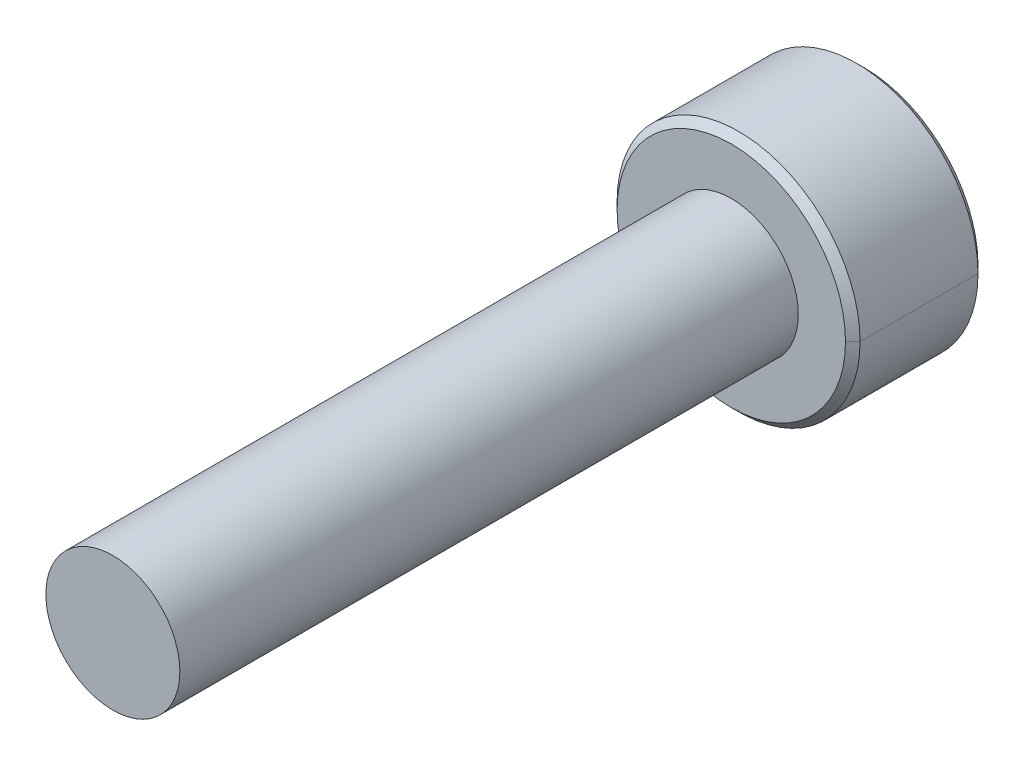
ISO-10303-21;
HEADER;
FILE_DESCRIPTION(('STEP AP214'),'2;1');
FILE_NAME('part.step','',(''),(''),'','','');
FILE_SCHEMA(('AUTOMOTIVE_DESIGN { 1 0 10303 214 1 1 1 1 }'));
ENDSEC;
DATA;
#1=APPLICATION_CONTEXT('core data for automotive mechanical design processes');
#2=APPLICATION_PROTOCOL_DEFINITION('international standard','automotive_design',2000,#1);
#3=PRODUCT_CONTEXT('',#1,'mechanical');
#4=PRODUCT('Part','Part','',(#3));
#5=PRODUCT_RELATED_PRODUCT_CATEGORY('part','',(#4));
#6=PRODUCT_DEFINITION_FORMATION('','',#4);
#7=PRODUCT_DEFINITION_CONTEXT('part definition',#1,'design');
#8=PRODUCT_DEFINITION('design','',#6,#7);
#9=PRODUCT_DEFINITION_SHAPE('','',#8);
#10=(LENGTH_UNIT() NAMED_UNIT(*) SI_UNIT(.MILLI.,.METRE.));
#11=(NAMED_UNIT(*) PLANE_ANGLE_UNIT() SI_UNIT($,.RADIAN.));
#12=(NAMED_UNIT(*) SI_UNIT($,.STERADIAN.) SOLID_ANGLE_UNIT());
#13=UNCERTAINTY_MEASURE_WITH_UNIT(LENGTH_MEASURE(1.E-05),#10,'distance_accuracy_value','');
#14=(GEOMETRIC_REPRESENTATION_CONTEXT(3) GLOBAL_UNCERTAINTY_ASSIGNED_CONTEXT((#13)) GLOBAL_UNIT_ASSIGNED_CONTEXT((#10,
#11,#12)) REPRESENTATION_CONTEXT('',''));
#15=CARTESIAN_POINT('',(0.,0.,0.));
#16=DIRECTION('',(0.,0.,1.));
#17=DIRECTION('',(1.,0.,0.));
#18=AXIS2_PLACEMENT_3D('',#15,#16,#17);
#19=CARTESIAN_POINT('',(0.,0.,-6.165));
#20=DIRECTION('',(0.,0.,-1.));
#21=DIRECTION('',(-1.,0.,0.));
#22=AXIS2_PLACEMENT_3D('',#19,#20,#21);
#23=CONICAL_SURFACE('',#22,2.75,0.785398163397453);
#24=CARTESIAN_POINT('',(0.,0.,-6.));
#25=DIRECTION('',(0.,0.,1.));
#26=DIRECTION('',(-1.,0.,0.));
#27=AXIS2_PLACEMENT_3D('',#24,#25,#26);
#28=CIRCLE('',#27,2.585);
#29=CARTESIAN_POINT('',(2.585,0.,-6.));
#30=VERTEX_POINT('',#29);
#31=CARTESIAN_POINT('',(-2.585,0.,-6.));
#32=VERTEX_POINT('',#31);
#33=EDGE_CURVE('E61',#30,#32,#28,.T.);
#34=ORIENTED_EDGE('',*,*,#33,.F.);
#35=DIRECTION('',(0.707106781186551,0.,-0.707106781186544));
#36=VECTOR('',#35,1.);
#37=CARTESIAN_POINT('',(2.75,0.,-6.165));
#38=LINE('',#37,#36);
#39=CARTESIAN_POINT('',(2.75,0.,-6.165));
#40=VERTEX_POINT('',#39);
#41=EDGE_CURVE('E11',#30,#40,#38,.T.);
#42=ORIENTED_EDGE('',*,*,#41,.T.);
#43=CARTESIAN_POINT('',(0.,0.,-6.165));
#44=DIRECTION('',(0.,0.,-1.));
#45=DIRECTION('',(-1.,0.,0.));
#46=AXIS2_PLACEMENT_3D('',#43,#44,#45);
#47=CIRCLE('',#46,2.75);
#48=CARTESIAN_POINT('',(-2.75,0.,-6.165));
#49=VERTEX_POINT('',#48);
#50=EDGE_CURVE('E475',#49,#40,#47,.T.);
#51=ORIENTED_EDGE('',*,*,#50,.F.);
#52=DIRECTION('',(-0.707106781186551,0.,-0.707106781186544));
#53=VECTOR('',#52,1.);
#54=CARTESIAN_POINT('',(-2.75,0.,-6.165));
#55=LINE('',#54,#53);
#56=EDGE_CURVE('E487',#32,#49,#55,.T.);
#57=ORIENTED_EDGE('',*,*,#56,.F.);
#58=EDGE_LOOP('',(#34,#42,#51,#57));
#59=FACE_BOUND('',#58,.T.);
#60=ADVANCED_FACE('F36',(#59),#23,.T.);
#61=CARTESIAN_POINT('',(0.,0.,-9.));
#62=DIRECTION('',(0.,0.,1.));
#63=DIRECTION('',(1.,0.,0.));
#64=AXIS2_PLACEMENT_3D('',#61,#62,#63);
#65=CONICAL_SURFACE('',#64,2.585,0.785398163397446);
#66=CARTESIAN_POINT('',(0.,0.,-9.));
#67=DIRECTION('',(0.,0.,-1.));
#68=DIRECTION('',(-1.,0.,0.));
#69=AXIS2_PLACEMENT_3D('',#66,#67,#68);
#70=CIRCLE('',#69,2.585);
#71=CARTESIAN_POINT('',(-2.585,0.,-9.));
#72=VERTEX_POINT('',#71);
#73=CARTESIAN_POINT('',(2.585,0.,-9.));
#74=VERTEX_POINT('',#73);
#75=EDGE_CURVE('E396',#72,#74,#70,.T.);
#76=ORIENTED_EDGE('',*,*,#75,.F.);
#77=DIRECTION('',(-0.707106781186546,0.,0.707106781186549));
#78=VECTOR('',#77,1.);
#79=CARTESIAN_POINT('',(-2.585,0.,-9.));
#80=LINE('',#79,#78);
#81=CARTESIAN_POINT('',(-2.75,0.,-8.835));
#82=VERTEX_POINT('',#81);
#83=EDGE_CURVE('E49',#72,#82,#80,.T.);
#84=ORIENTED_EDGE('',*,*,#83,.T.);
#85=CARTESIAN_POINT('',(0.,0.,-8.835));
#86=DIRECTION('',(0.,0.,1.));
#87=DIRECTION('',(-1.,0.,0.));
#88=AXIS2_PLACEMENT_3D('',#85,#86,#87);
#89=CIRCLE('',#88,2.75);
#90=CARTESIAN_POINT('',(2.75,0.,-8.835));
#91=VERTEX_POINT('',#90);
#92=EDGE_CURVE('E468',#91,#82,#89,.T.);
#93=ORIENTED_EDGE('',*,*,#92,.F.);
#94=DIRECTION('',(0.707106781186546,0.,0.707106781186549));
#95=VECTOR('',#94,1.);
#96=CARTESIAN_POINT('',(2.585,0.,-9.));
#97=LINE('',#96,#95);
#98=EDGE_CURVE('E400',#74,#91,#97,.T.);
#99=ORIENTED_EDGE('',*,*,#98,.F.);
#100=EDGE_LOOP('',(#76,#84,#93,#99));
#101=FACE_BOUND('',#100,.T.);
#102=ADVANCED_FACE('F246',(#101),#65,.T.);
#103=CARTESIAN_POINT('',(0.,0.,-9.));
#104=DIRECTION('',(0.,0.,-1.));
#105=DIRECTION('',(-1.,0.,0.));
#106=AXIS2_PLACEMENT_3D('',#103,#104,#105);
#107=CONICAL_SURFACE('',#106,1.44337567297406,0.78539816339745);
#108=CARTESIAN_POINT('',(-1.25,0.,-8.80662432702593));
#109=CARTESIAN_POINT('',(-1.25,0.180896648900341,-8.80662432702593));
#110=CARTESIAN_POINT('',(-1.25,0.371633306232305,-8.8606992153283));
#111=CARTESIAN_POINT('',(-1.25,0.536655871568181,-8.90748401754058));
#112=CARTESIAN_POINT('',(-1.25,0.721687836487031,-9.));
#113=B_SPLINE_CURVE_WITH_KNOTS('',2,(#108,#109,#110,#111,#112),.UNSPECIFIED.,.F.,.F.,(3,2,3),
(0.,0.5,1.),.UNSPECIFIED.);
#114=CARTESIAN_POINT('',(-1.25,0.,-8.80662432702594));
#115=VERTEX_POINT('',#114);
#116=CARTESIAN_POINT('',(-1.25,0.721687836487032,-9.));
#117=VERTEX_POINT('',#116);
#118=EDGE_CURVE('E184',#115,#117,#113,.T.);
#119=ORIENTED_EDGE('',*,*,#118,.F.);
#120=DIRECTION('',(-0.707106781186549,0.,-0.707106781186546));
#121=VECTOR('',#120,1.);
#122=CARTESIAN_POINT('',(-1.44337567297406,0.,-9.));
#123=LINE('',#122,#121);
#124=CARTESIAN_POINT('',(-1.44337567297406,0.,-9.));
#125=VERTEX_POINT('',#124);
#126=EDGE_CURVE('E413',#115,#125,#123,.T.);
#127=ORIENTED_EDGE('',*,*,#126,.T.);
#128=CARTESIAN_POINT('',(0.,0.,-9.));
#129=DIRECTION('',(0.,0.,-1.));
#130=DIRECTION('',(-1.,0.,0.));
#131=AXIS2_PLACEMENT_3D('',#128,#129,#130);
#132=CIRCLE('',#131,1.44337567297406);
#133=EDGE_CURVE('E233',#125,#117,#132,.T.);
#134=ORIENTED_EDGE('',*,*,#133,.T.);
#135=EDGE_LOOP('',(#119,#127,#134));
#136=FACE_BOUND('',#135,.T.);
#137=ADVANCED_FACE('F235',(#136),#107,.F.);
#138=CARTESIAN_POINT('',(0.,0.,-9.));
#139=DIRECTION('',(0.,0.,1.));
#140=DIRECTION('',(1.,0.,0.));
#141=AXIS2_PLACEMENT_3D('',#138,#139,#140);
#142=CYLINDRICAL_SURFACE('',#141,2.75);
#143=ORIENTED_EDGE('',*,*,#92,.T.);
#144=DIRECTION('',(0.,0.,1.));
#145=VECTOR('',#144,1.);
#146=CARTESIAN_POINT('',(-2.75,0.,-9.));
#147=LINE('',#146,#145);
#148=EDGE_CURVE('E427',#82,#49,#147,.T.);
#149=ORIENTED_EDGE('',*,*,#148,.T.);
#150=ORIENTED_EDGE('',*,*,#50,.T.);
#151=DIRECTION('',(0.,0.,1.));
#152=VECTOR('',#151,1.);
#153=CARTESIAN_POINT('',(2.75,0.,-9.));
#154=LINE('',#153,#152);
#155=EDGE_CURVE('E423',#91,#40,#154,.T.);
#156=ORIENTED_EDGE('',*,*,#155,.F.);
#157=EDGE_LOOP('',(#143,#149,#150,#156));
#158=FACE_BOUND('',#157,.T.);
#159=ADVANCED_FACE('F245',(#158),#142,.T.);
#160=CARTESIAN_POINT('',(0.,0.,-9.));
#161=DIRECTION('',(0.,0.,1.));
#162=DIRECTION('',(1.,0.,0.));
#163=AXIS2_PLACEMENT_3D('',#160,#161,#162);
#164=CYLINDRICAL_SURFACE('',#163,2.75);
#165=ORIENTED_EDGE('',*,*,#148,.F.);
#166=CARTESIAN_POINT('',(0.,0.,-8.835));
#167=DIRECTION('',(0.,0.,1.));
#168=DIRECTION('',(-1.,0.,0.));
#169=AXIS2_PLACEMENT_3D('',#166,#167,#168);
#170=CIRCLE('',#169,2.75);
#171=EDGE_CURVE('E411',#82,#91,#170,.T.);
#172=ORIENTED_EDGE('',*,*,#171,.T.);
#173=ORIENTED_EDGE('',*,*,#155,.T.);
#174=CARTESIAN_POINT('',(0.,0.,-6.165));
#175=DIRECTION('',(0.,0.,-1.));
#176=DIRECTION('',(-1.,0.,0.));
#177=AXIS2_PLACEMENT_3D('',#174,#175,#176);
#178=CIRCLE('',#177,2.75);
#179=EDGE_CURVE('E417',#40,#49,#178,.T.);
#180=ORIENTED_EDGE('',*,*,#179,.T.);
#181=EDGE_LOOP('',(#165,#172,#173,#180));
#182=FACE_BOUND('',#181,.T.);
#183=ADVANCED_FACE('F378',(#182),#164,.T.);
#184=CARTESIAN_POINT('',(0.,0.,-9.));
#185=DIRECTION('',(0.,0.,-1.));
#186=DIRECTION('',(0.,-1.,0.));
#187=AXIS2_PLACEMENT_3D('',#184,#185,#186);
#188=PLANE('',#187);
#189=CARTESIAN_POINT('',(0.,0.,-9.));
#190=DIRECTION('',(0.,0.,-1.));
#191=DIRECTION('',(-1.,0.,0.));
#192=AXIS2_PLACEMENT_3D('',#189,#190,#191);
#193=CIRCLE('',#192,2.585);
#194=EDGE_CURVE('E405',#74,#72,#193,.T.);
#195=ORIENTED_EDGE('',*,*,#194,.T.);
#196=ORIENTED_EDGE('',*,*,#75,.T.);
#197=EDGE_LOOP('',(#195,#196));
#198=FACE_BOUND('',#197,.T.);
#199=CARTESIAN_POINT('',(0.,0.,-9.));
#200=DIRECTION('',(0.,0.,-1.));
#201=DIRECTION('',(-1.,0.,0.));
#202=AXIS2_PLACEMENT_3D('',#199,#200,#201);
#203=CIRCLE('',#202,1.44337567297406);
#204=CARTESIAN_POINT('',(0.,1.44337567297406,-9.));
#205=VERTEX_POINT('',#204);
#206=EDGE_CURVE('E307',#117,#205,#203,.T.);
#207=ORIENTED_EDGE('',*,*,#206,.F.);
#208=ORIENTED_EDGE('',*,*,#133,.F.);
#209=CARTESIAN_POINT('',(0.,0.,-9.));
#210=DIRECTION('',(0.,0.,-1.));
#211=DIRECTION('',(-1.,0.,0.));
#212=AXIS2_PLACEMENT_3D('',#209,#210,#211);
#213=CIRCLE('',#212,1.44337567297406);
#214=CARTESIAN_POINT('',(-1.25,-0.721687836487033,-9.));
#215=VERTEX_POINT('',#214);
#216=EDGE_CURVE('E271',#215,#125,#213,.T.);
#217=ORIENTED_EDGE('',*,*,#216,.F.);
#218=CARTESIAN_POINT('',(0.,0.,-9.));
#219=DIRECTION('',(0.,0.,-1.));
#220=DIRECTION('',(-1.,0.,0.));
#221=AXIS2_PLACEMENT_3D('',#218,#219,#220);
#222=CIRCLE('',#221,1.44337567297406);
#223=CARTESIAN_POINT('',(0.,-1.44337567297406,-9.));
#224=VERTEX_POINT('',#223);
#225=EDGE_CURVE('E262',#224,#215,#222,.T.);
#226=ORIENTED_EDGE('',*,*,#225,.F.);
#227=CARTESIAN_POINT('',(0.,0.,-9.));
#228=DIRECTION('',(0.,0.,-1.));
#229=DIRECTION('',(-1.,0.,0.));
#230=AXIS2_PLACEMENT_3D('',#227,#228,#229);
#231=CIRCLE('',#230,1.44337567297406);
#232=CARTESIAN_POINT('',(1.25,-0.721687836487033,-9.));
#233=VERTEX_POINT('',#232);
#234=EDGE_CURVE('E270',#233,#224,#231,.T.);
#235=ORIENTED_EDGE('',*,*,#234,.F.);
#236=CARTESIAN_POINT('',(0.,0.,-9.));
#237=DIRECTION('',(0.,0.,-1.));
#238=DIRECTION('',(-1.,0.,0.));
#239=AXIS2_PLACEMENT_3D('',#236,#237,#238);
#240=CIRCLE('',#239,1.44337567297406);
#241=CARTESIAN_POINT('',(1.25,0.721687836487033,-9.));
#242=VERTEX_POINT('',#241);
#243=EDGE_CURVE('E335',#242,#233,#240,.T.);
#244=ORIENTED_EDGE('',*,*,#243,.F.);
#245=CARTESIAN_POINT('',(0.,0.,-9.));
#246=DIRECTION('',(0.,0.,-1.));
#247=DIRECTION('',(-1.,0.,0.));
#248=AXIS2_PLACEMENT_3D('',#245,#246,#247);
#249=CIRCLE('',#248,1.44337567297406);
#250=EDGE_CURVE('E331',#205,#242,#249,.T.);
#251=ORIENTED_EDGE('',*,*,#250,.F.);
#252=EDGE_LOOP('',(#207,#208,#217,#226,#235,#244,#251));
#253=FACE_BOUND('',#252,.T.);
#254=ADVANCED_FACE('F383',(#198,#253),#188,.T.);
#255=CARTESIAN_POINT('',(0.,0.,-6.));
#256=DIRECTION('',(0.,0.,-1.));
#257=DIRECTION('',(0.,-1.,0.));
#258=AXIS2_PLACEMENT_3D('',#255,#256,#257);
#259=PLANE('',#258);
#260=CARTESIAN_POINT('',(0.,0.,-6.));
#261=DIRECTION('',(0.,0.,-1.));
#262=DIRECTION('',(-1.,0.,0.));
#263=AXIS2_PLACEMENT_3D('',#260,#261,#262);
#264=CIRCLE('',#263,1.51645395010895);
#265=CARTESIAN_POINT('',(-1.51645395010895,0.,-6.));
#266=VERTEX_POINT('',#265);
#267=EDGE_CURVE('E499',#266,#266,#264,.F.);
#268=ORIENTED_EDGE('',*,*,#267,.F.);
#269=EDGE_LOOP('',(#268));
#270=FACE_BOUND('',#269,.T.);
#271=CARTESIAN_POINT('',(0.,0.,-6.));
#272=DIRECTION('',(0.,0.,1.));
#273=DIRECTION('',(-1.,0.,0.));
#274=AXIS2_PLACEMENT_3D('',#271,#272,#273);
#275=CIRCLE('',#274,2.585);
#276=EDGE_CURVE('E406',#32,#30,#275,.T.);
#277=ORIENTED_EDGE('',*,*,#276,.T.);
#278=ORIENTED_EDGE('',*,*,#33,.T.);
#279=EDGE_LOOP('',(#277,#278));
#280=FACE_BOUND('',#279,.T.);
#281=ADVANCED_FACE('F519',(#270,#280),#259,.F.);
#282=CARTESIAN_POINT('',(0.,0.,-9.));
#283=DIRECTION('',(0.,0.,-1.));
#284=DIRECTION('',(-1.,0.,0.));
#285=AXIS2_PLACEMENT_3D('',#282,#283,#284);
#286=CONICAL_SURFACE('',#285,1.44337567297406,0.78539816339745);
#287=ORIENTED_EDGE('',*,*,#250,.T.);
#288=CARTESIAN_POINT('',(0.,1.44337567297406,-9.));
#289=CARTESIAN_POINT('',(0.33343931272324,1.2508643960149,-8.80748872304083));
#290=CARTESIAN_POINT('',(0.622697264378245,1.08386123976164,-8.80662715507142));
#291=CARTESIAN_POINT('',(0.91356780893043,0.915927052565104,-8.8057607839207));
#292=CARTESIAN_POINT('',(1.25,0.721687836487032,-9.));
#293=B_SPLINE_CURVE_WITH_KNOTS('',2,(#288,#289,#290,#291,#292),.UNSPECIFIED.,.F.,.F.,(3,2,3),
(0.,0.5,1.),.UNSPECIFIED.);
#294=EDGE_CURVE('E341',#205,#242,#293,.T.);
#295=ORIENTED_EDGE('',*,*,#294,.F.);
#296=EDGE_LOOP('',(#287,#295));
#297=FACE_BOUND('',#296,.T.);
#298=ADVANCED_FACE('F522',(#297),#286,.F.);
#299=CARTESIAN_POINT('',(0.,0.,-9.));
#300=DIRECTION('',(0.,0.,-1.));
#301=DIRECTION('',(-1.,0.,0.));
#302=AXIS2_PLACEMENT_3D('',#299,#300,#301);
#303=CONICAL_SURFACE('',#302,1.44337567297406,0.78539816339745);
#304=ORIENTED_EDGE('',*,*,#243,.T.);
#305=CARTESIAN_POINT('',(1.25,0.721687836487033,-9.));
#306=CARTESIAN_POINT('',(1.25,0.538092414489122,-8.90820228900105));
#307=CARTESIAN_POINT('',(1.25,0.371670740916257,-8.86070988390206));
#308=CARTESIAN_POINT('',(1.25,0.182469151639214,-8.8067166849971));
#309=CARTESIAN_POINT('',(1.25,7.86844095029566E-05,-8.80662432950243));
#310=CARTESIAN_POINT('',(1.25,-0.1812567100001,-8.80653250825594));
#311=CARTESIAN_POINT('',(1.25,-0.371515987727131,-8.86066578692546));
#312=CARTESIAN_POINT('',(1.25,-0.537435467853739,-8.90787381568336));
#313=CARTESIAN_POINT('',(1.25,-0.721687836487031,-9.));
#314=B_SPLINE_CURVE_WITH_KNOTS('',2,(#305,#306,#307,#308,#309,#310,#311,#312,#313),
.UNSPECIFIED.,.F.,.F.,(3,2,2,2,3),(0.,0.25,0.5,0.75,1.),.UNSPECIFIED.);
#315=EDGE_CURVE('E353',#242,#233,#314,.T.);
#316=ORIENTED_EDGE('',*,*,#315,.F.);
#317=EDGE_LOOP('',(#304,#316));
#318=FACE_BOUND('',#317,.T.);
#319=ADVANCED_FACE('F253',(#318),#303,.F.);
#320=CARTESIAN_POINT('',(0.,0.,-9.));
#321=DIRECTION('',(0.,0.,-1.));
#322=DIRECTION('',(-1.,0.,0.));
#323=AXIS2_PLACEMENT_3D('',#320,#321,#322);
#324=CONICAL_SURFACE('',#323,1.44337567297406,0.78539816339745);
#325=ORIENTED_EDGE('',*,*,#234,.T.);
#326=CARTESIAN_POINT('',(1.25,-0.721687836487033,-9.));
#327=CARTESIAN_POINT('',(0.916560687278648,-0.91419911344511,-8.80748872304191));
#328=CARTESIAN_POINT('',(0.627302735621754,-1.08120226969946,-8.80662715507142));
#329=CARTESIAN_POINT('',(0.336432191071441,-1.24913645689491,-8.80576078391962));
#330=CARTESIAN_POINT('',(0.,-1.44337567297406,-9.));
#331=B_SPLINE_CURVE_WITH_KNOTS('',2,(#326,#327,#328,#329,#330),.UNSPECIFIED.,.F.,.F.,(3,2,3),
(0.,0.5,1.),.UNSPECIFIED.);
#332=EDGE_CURVE('E276',#233,#224,#331,.T.);
#333=ORIENTED_EDGE('',*,*,#332,.F.);
#334=EDGE_LOOP('',(#325,#333));
#335=FACE_BOUND('',#334,.T.);
#336=ADVANCED_FACE('F248',(#335),#324,.F.);
#337=CARTESIAN_POINT('',(0.,0.,-9.));
#338=DIRECTION('',(0.,0.,-1.));
#339=DIRECTION('',(-1.,0.,0.));
#340=AXIS2_PLACEMENT_3D('',#337,#338,#339);
#341=CONICAL_SURFACE('',#340,1.44337567297406,0.78539816339745);
#342=ORIENTED_EDGE('',*,*,#225,.T.);
#343=CARTESIAN_POINT('',(0.,-1.44337567297406,-9.));
#344=CARTESIAN_POINT('',(-0.333439312720416,-1.25086439601653,-8.80748872304245));
#345=CARTESIAN_POINT('',(-0.622697264378245,-1.08386123976164,-8.80662715507142));
#346=CARTESIAN_POINT('',(-0.913567808927632,-0.915927052566719,-8.80576078391908));
#347=CARTESIAN_POINT('',(-1.25,-0.721687836487032,-9.));
#348=B_SPLINE_CURVE_WITH_KNOTS('',2,(#343,#344,#345,#346,#347),.UNSPECIFIED.,.F.,.F.,(3,2,3),
(0.,0.5,1.),.UNSPECIFIED.);
#349=EDGE_CURVE('E172',#224,#215,#348,.T.);
#350=ORIENTED_EDGE('',*,*,#349,.F.);
#351=EDGE_LOOP('',(#342,#350));
#352=FACE_BOUND('',#351,.T.);
#353=ADVANCED_FACE('F252',(#352),#341,.F.);
#354=CARTESIAN_POINT('',(0.,0.,-9.));
#355=DIRECTION('',(0.,0.,-1.));
#356=DIRECTION('',(-1.,0.,0.));
#357=AXIS2_PLACEMENT_3D('',#354,#355,#356);
#358=CONICAL_SURFACE('',#357,1.44337567297406,0.78539816339745);
#359=ORIENTED_EDGE('',*,*,#126,.F.);
#360=CARTESIAN_POINT('',(-1.25,-0.721687836487033,-9.));
#361=CARTESIAN_POINT('',(-1.25,-0.538882168791653,-8.90859716615231));
#362=CARTESIAN_POINT('',(-1.25,-0.371553327845961,-8.86067642546119));
#363=CARTESIAN_POINT('',(-1.25,-0.182815114466653,-8.80662432702593));
#364=CARTESIAN_POINT('',(-1.25,0.,-8.80662432702593));
#365=B_SPLINE_CURVE_WITH_KNOTS('',2,(#360,#361,#362,#363,#364),.UNSPECIFIED.,.F.,.F.,(3,2,3),
(0.,0.5,1.),.UNSPECIFIED.);
#366=EDGE_CURVE('E176',#215,#115,#365,.T.);
#367=ORIENTED_EDGE('',*,*,#366,.F.);
#368=ORIENTED_EDGE('',*,*,#216,.T.);
#369=EDGE_LOOP('',(#359,#367,#368));
#370=FACE_BOUND('',#369,.T.);
#371=ADVANCED_FACE('F296',(#370),#358,.F.);
#372=CARTESIAN_POINT('',(0.,0.,-9.));
#373=DIRECTION('',(0.,0.,-1.));
#374=DIRECTION('',(-1.,0.,0.));
#375=AXIS2_PLACEMENT_3D('',#372,#373,#374);
#376=CONICAL_SURFACE('',#375,1.44337567297406,0.78539816339745);
#377=ORIENTED_EDGE('',*,*,#206,.T.);
#378=CARTESIAN_POINT('',(-1.25,0.721687836487033,-9.));
#379=CARTESIAN_POINT('',(-0.916560687279589,0.914199113444566,-8.80748872304245));
#380=CARTESIAN_POINT('',(-0.627302735621754,1.08120226969946,-8.80662715507142));
#381=CARTESIAN_POINT('',(-0.336432191072373,1.24913645689438,-8.80576078391908));
#382=CARTESIAN_POINT('',(0.,1.44337567297407,-9.));
#383=B_SPLINE_CURVE_WITH_KNOTS('',2,(#378,#379,#380,#381,#382),.UNSPECIFIED.,.F.,.F.,(3,2,3),
(0.,0.5,1.),.UNSPECIFIED.);
#384=EDGE_CURVE('E486',#117,#205,#383,.T.);
#385=ORIENTED_EDGE('',*,*,#384,.F.);
#386=EDGE_LOOP('',(#377,#385));
#387=FACE_BOUND('',#386,.T.);
#388=ADVANCED_FACE('F376',(#387),#376,.F.);
#389=CARTESIAN_POINT('',(1.25,2.1650635094611,-7.125));
#390=DIRECTION('',(0.,0.,-1.));
#391=DIRECTION('',(0.,-1.,0.));
#392=AXIS2_PLACEMENT_3D('',#389,#390,#391);
#393=PLANE('',#392);
#394=DIRECTION('',(0.866025403784439,0.5,0.));
#395=VECTOR('',#394,1.);
#396=CARTESIAN_POINT('',(-1.25,0.721687836487033,-7.125));
#397=LINE('',#396,#395);
#398=CARTESIAN_POINT('',(-1.25,0.721687836487033,-7.125));
#399=VERTEX_POINT('',#398);
#400=CARTESIAN_POINT('',(0.,1.44337567297406,-7.125));
#401=VERTEX_POINT('',#400);
#402=EDGE_CURVE('E314',#399,#401,#397,.T.);
#403=ORIENTED_EDGE('',*,*,#402,.T.);
#404=DIRECTION('',(0.866025403784439,-0.5,0.));
#405=VECTOR('',#404,1.);
#406=CARTESIAN_POINT('',(0.,1.44337567297406,-7.125));
#407=LINE('',#406,#405);
#408=CARTESIAN_POINT('',(1.25,0.721687836487033,-7.125));
#409=VERTEX_POINT('',#408);
#410=EDGE_CURVE('E322',#401,#409,#407,.T.);
#411=ORIENTED_EDGE('',*,*,#410,.T.);
#412=DIRECTION('',(0.,-1.,0.));
#413=VECTOR('',#412,1.);
#414=CARTESIAN_POINT('',(1.25,0.721687836487033,-7.125));
#415=LINE('',#414,#413);
#416=CARTESIAN_POINT('',(1.25,-0.721687836487033,-7.125));
#417=VERTEX_POINT('',#416);
#418=EDGE_CURVE('E430',#409,#417,#415,.T.);
#419=ORIENTED_EDGE('',*,*,#418,.T.);
#420=DIRECTION('',(-0.866025403784439,-0.5,0.));
#421=VECTOR('',#420,1.);
#422=CARTESIAN_POINT('',(1.25,-0.721687836487033,-7.125));
#423=LINE('',#422,#421);
#424=CARTESIAN_POINT('',(0.,-1.44337567297406,-7.125));
#425=VERTEX_POINT('',#424);
#426=EDGE_CURVE('E166',#417,#425,#423,.T.);
#427=ORIENTED_EDGE('',*,*,#426,.T.);
#428=DIRECTION('',(-0.866025403784439,0.5,0.));
#429=VECTOR('',#428,1.);
#430=CARTESIAN_POINT('',(0.,-1.44337567297406,-7.125));
#431=LINE('',#430,#429);
#432=CARTESIAN_POINT('',(-1.25,-0.721687836487033,-7.125));
#433=VERTEX_POINT('',#432);
#434=EDGE_CURVE('E143',#425,#433,#431,.T.);
#435=ORIENTED_EDGE('',*,*,#434,.T.);
#436=DIRECTION('',(0.,1.,0.));
#437=VECTOR('',#436,1.);
#438=CARTESIAN_POINT('',(-1.25,-0.721687836487033,-7.125));
#439=LINE('',#438,#437);
#440=EDGE_CURVE('E151',#433,#399,#439,.T.);
#441=ORIENTED_EDGE('',*,*,#440,.T.);
#442=EDGE_LOOP('',(#403,#411,#419,#427,#435,#441));
#443=FACE_BOUND('',#442,.T.);
#444=ADVANCED_FACE('F164',(#443),#393,.T.);
#445=CARTESIAN_POINT('',(0.,1.44337567297406,-7.125));
#446=DIRECTION('',(0.5,0.866025403784439,0.));
#447=DIRECTION('',(0.,0.,-1.));
#448=AXIS2_PLACEMENT_3D('',#445,#446,#447);
#449=PLANE('',#448);
#450=DIRECTION('',(0.,0.,-1.));
#451=VECTOR('',#450,1.);
#452=CARTESIAN_POINT('',(0.,1.44337567297406,-7.125));
#453=LINE('',#452,#451);
#454=EDGE_CURVE('E162',#401,#205,#453,.T.);
#455=ORIENTED_EDGE('',*,*,#454,.T.);
#456=ORIENTED_EDGE('',*,*,#294,.T.);
#457=DIRECTION('',(0.,0.,-1.));
#458=VECTOR('',#457,1.);
#459=CARTESIAN_POINT('',(1.25,0.721687836487033,-7.125));
#460=LINE('',#459,#458);
#461=EDGE_CURVE('E349',#409,#242,#460,.T.);
#462=ORIENTED_EDGE('',*,*,#461,.F.);
#463=ORIENTED_EDGE('',*,*,#410,.F.);
#464=EDGE_LOOP('',(#455,#456,#462,#463));
#465=FACE_BOUND('',#464,.T.);
#466=ADVANCED_FACE('F374',(#465),#449,.F.);
#467=CARTESIAN_POINT('',(1.25,0.721687836487033,-7.125));
#468=DIRECTION('',(1.,0.,0.));
#469=DIRECTION('',(0.,1.,0.));
#470=AXIS2_PLACEMENT_3D('',#467,#468,#469);
#471=PLANE('',#470);
#472=ORIENTED_EDGE('',*,*,#461,.T.);
#473=ORIENTED_EDGE('',*,*,#315,.T.);
#474=DIRECTION('',(0.,0.,-1.));
#475=VECTOR('',#474,1.);
#476=CARTESIAN_POINT('',(1.25,-0.721687836487033,-7.125));
#477=LINE('',#476,#475);
#478=EDGE_CURVE('E559',#417,#233,#477,.T.);
#479=ORIENTED_EDGE('',*,*,#478,.F.);
#480=ORIENTED_EDGE('',*,*,#418,.F.);
#481=EDGE_LOOP('',(#472,#473,#479,#480));
#482=FACE_BOUND('',#481,.T.);
#483=ADVANCED_FACE('F365',(#482),#471,.F.);
#484=CARTESIAN_POINT('',(1.25,-0.721687836487033,-7.125));
#485=DIRECTION('',(0.5,-0.866025403784439,0.));
#486=DIRECTION('',(0.,0.,-1.));
#487=AXIS2_PLACEMENT_3D('',#484,#485,#486);
#488=PLANE('',#487);
#489=ORIENTED_EDGE('',*,*,#478,.T.);
#490=ORIENTED_EDGE('',*,*,#332,.T.);
#491=DIRECTION('',(0.,0.,-1.));
#492=VECTOR('',#491,1.);
#493=CARTESIAN_POINT('',(0.,-1.44337567297406,-7.125));
#494=LINE('',#493,#492);
#495=EDGE_CURVE('E182',#425,#224,#494,.T.);
#496=ORIENTED_EDGE('',*,*,#495,.F.);
#497=ORIENTED_EDGE('',*,*,#426,.F.);
#498=EDGE_LOOP('',(#489,#490,#496,#497));
#499=FACE_BOUND('',#498,.T.);
#500=ADVANCED_FACE('F207',(#499),#488,.F.);
#501=CARTESIAN_POINT('',(0.,-1.44337567297406,-7.125));
#502=DIRECTION('',(-0.5,-0.866025403784439,0.));
#503=DIRECTION('',(-0.866025403784439,0.5,0.));
#504=AXIS2_PLACEMENT_3D('',#501,#502,#503);
#505=PLANE('',#504);
#506=ORIENTED_EDGE('',*,*,#495,.T.);
#507=ORIENTED_EDGE('',*,*,#349,.T.);
#508=DIRECTION('',(0.,0.,-1.));
#509=VECTOR('',#508,1.);
#510=CARTESIAN_POINT('',(-1.25,-0.721687836487033,-7.125));
#511=LINE('',#510,#509);
#512=EDGE_CURVE('E154',#433,#215,#511,.T.);
#513=ORIENTED_EDGE('',*,*,#512,.F.);
#514=ORIENTED_EDGE('',*,*,#434,.F.);
#515=EDGE_LOOP('',(#506,#507,#513,#514));
#516=FACE_BOUND('',#515,.T.);
#517=ADVANCED_FACE('F171',(#516),#505,.F.);
#518=CARTESIAN_POINT('',(-1.25,-0.721687836487033,-7.125));
#519=DIRECTION('',(-1.,0.,0.));
#520=DIRECTION('',(0.,0.,1.));
#521=AXIS2_PLACEMENT_3D('',#518,#519,#520);
#522=PLANE('',#521);
#523=ORIENTED_EDGE('',*,*,#512,.T.);
#524=ORIENTED_EDGE('',*,*,#366,.T.);
#525=ORIENTED_EDGE('',*,*,#118,.T.);
#526=DIRECTION('',(0.,0.,-1.));
#527=VECTOR('',#526,1.);
#528=CARTESIAN_POINT('',(-1.25,0.721687836487033,-7.125));
#529=LINE('',#528,#527);
#530=EDGE_CURVE('E157',#399,#117,#529,.T.);
#531=ORIENTED_EDGE('',*,*,#530,.F.);
#532=ORIENTED_EDGE('',*,*,#440,.F.);
#533=EDGE_LOOP('',(#523,#524,#525,#531,#532));
#534=FACE_BOUND('',#533,.T.);
#535=ADVANCED_FACE('F152',(#534),#522,.F.);
#536=CARTESIAN_POINT('',(-1.25,0.721687836487033,-7.125));
#537=DIRECTION('',(-0.5,0.866025403784439,0.));
#538=DIRECTION('',(0.,0.,1.));
#539=AXIS2_PLACEMENT_3D('',#536,#537,#538);
#540=PLANE('',#539);
#541=ORIENTED_EDGE('',*,*,#530,.T.);
#542=ORIENTED_EDGE('',*,*,#384,.T.);
#543=ORIENTED_EDGE('',*,*,#454,.F.);
#544=ORIENTED_EDGE('',*,*,#402,.F.);
#545=EDGE_LOOP('',(#541,#542,#543,#544));
#546=FACE_BOUND('',#545,.T.);
#547=ADVANCED_FACE('F206',(#546),#540,.F.);
#548=CARTESIAN_POINT('',(0.,0.,-9.));
#549=DIRECTION('',(0.,0.,1.));
#550=DIRECTION('',(1.,0.,0.));
#551=AXIS2_PLACEMENT_3D('',#548,#549,#550);
#552=CONICAL_SURFACE('',#551,2.585,0.785398163397446);
#553=ORIENTED_EDGE('',*,*,#83,.F.);
#554=ORIENTED_EDGE('',*,*,#194,.F.);
#555=ORIENTED_EDGE('',*,*,#98,.T.);
#556=ORIENTED_EDGE('',*,*,#171,.F.);
#557=EDGE_LOOP('',(#553,#554,#555,#556));
#558=FACE_BOUND('',#557,.T.);
#559=ADVANCED_FACE('F409',(#558),#552,.T.);
#560=CARTESIAN_POINT('',(0.,0.,-6.165));
#561=DIRECTION('',(0.,0.,-1.));
#562=DIRECTION('',(-1.,0.,0.));
#563=AXIS2_PLACEMENT_3D('',#560,#561,#562);
#564=CONICAL_SURFACE('',#563,2.75,0.785398163397453);
#565=ORIENTED_EDGE('',*,*,#41,.F.);
#566=ORIENTED_EDGE('',*,*,#276,.F.);
#567=ORIENTED_EDGE('',*,*,#56,.T.);
#568=ORIENTED_EDGE('',*,*,#179,.F.);
#569=EDGE_LOOP('',(#565,#566,#567,#568));
#570=FACE_BOUND('',#569,.T.);
#571=ADVANCED_FACE('F38',(#570),#564,.T.);
#572=CARTESIAN_POINT('',(0.,0.,-9.002));
#573=DIRECTION('',(0.,0.,1.));
#574=DIRECTION('',(1.,0.,0.));
#575=AXIS2_PLACEMENT_3D('',#572,#573,#574);
#576=CYLINDRICAL_SURFACE('',#575,1.51645395010895);
#577=ORIENTED_EDGE('',*,*,#267,.T.);
#578=EDGE_LOOP('',(#577));
#579=FACE_BOUND('',#578,.T.);
#580=CARTESIAN_POINT('',(0.,0.,8.));
#581=DIRECTION('',(0.,0.,1.));
#582=DIRECTION('',(1.,0.,0.));
#583=AXIS2_PLACEMENT_3D('',#580,#581,#582);
#584=CIRCLE('',#583,1.51645395010895);
#585=CARTESIAN_POINT('',(1.51645395010895,0.,8.));
#586=VERTEX_POINT('',#585);
#587=EDGE_CURVE('E504',#586,#586,#584,.T.);
#588=ORIENTED_EDGE('',*,*,#587,.F.);
#589=EDGE_LOOP('',(#588));
#590=FACE_BOUND('',#589,.T.);
#591=ADVANCED_FACE('F449',(#579,#590),#576,.T.);
#592=CARTESIAN_POINT('',(0.,0.,8.));
#593=DIRECTION('',(0.,0.,1.));
#594=DIRECTION('',(1.,0.,0.));
#595=AXIS2_PLACEMENT_3D('',#592,#593,#594);
#596=PLANE('',#595);
#597=ORIENTED_EDGE('',*,*,#587,.T.);
#598=EDGE_LOOP('',(#597));
#599=FACE_BOUND('',#598,.T.);
#600=ADVANCED_FACE('F508',(#599),#596,.T.);
#601=CLOSED_SHELL('',(#60,#102,#137,#159,#183,#254,#281,#298,#319,#336,#353,#371,#388,#444,#466,
#483,#500,#517,#535,#547,#559,#571,#591,#600));
#602=MANIFOLD_SOLID_BREP('B2',#601);
#603=ADVANCED_BREP_SHAPE_REPRESENTATION('',(#18,#602),#14);
#604=SHAPE_DEFINITION_REPRESENTATION(#9,#603);
ENDSEC;
END-ISO-10303-21;
